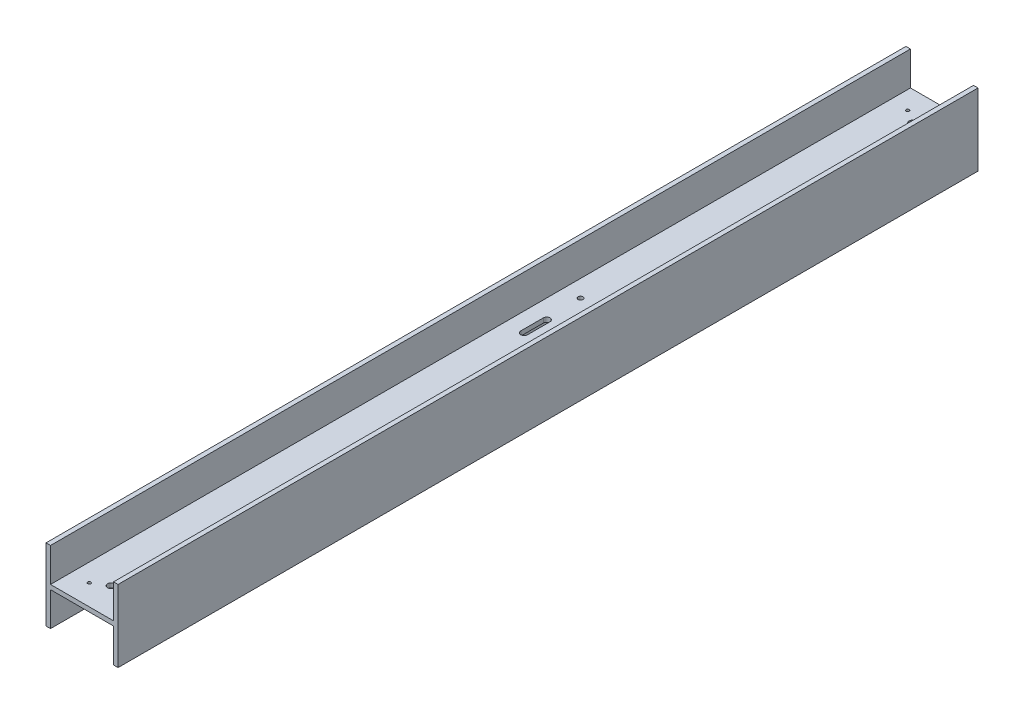
ISO-10303-21;
HEADER;
FILE_DESCRIPTION(('STEP AP214'),'2;1');
FILE_NAME('part.step','',(''),(''),'','','');
FILE_SCHEMA(('AUTOMOTIVE_DESIGN { 1 0 10303 214 1 1 1 1 }'));
ENDSEC;
DATA;
#1=APPLICATION_CONTEXT('core data for automotive mechanical design processes');
#2=APPLICATION_PROTOCOL_DEFINITION('international standard','automotive_design',2000,#1);
#3=PRODUCT_CONTEXT('',#1,'mechanical');
#4=PRODUCT('Part','Part','',(#3));
#5=PRODUCT_RELATED_PRODUCT_CATEGORY('part','',(#4));
#6=PRODUCT_DEFINITION_FORMATION('','',#4);
#7=PRODUCT_DEFINITION_CONTEXT('part definition',#1,'design');
#8=PRODUCT_DEFINITION('design','',#6,#7);
#9=PRODUCT_DEFINITION_SHAPE('','',#8);
#10=(LENGTH_UNIT() NAMED_UNIT(*) SI_UNIT(.MILLI.,.METRE.));
#11=(NAMED_UNIT(*) PLANE_ANGLE_UNIT() SI_UNIT($,.RADIAN.));
#12=(NAMED_UNIT(*) SI_UNIT($,.STERADIAN.) SOLID_ANGLE_UNIT());
#13=UNCERTAINTY_MEASURE_WITH_UNIT(LENGTH_MEASURE(1.E-05),#10,'distance_accuracy_value','');
#14=(GEOMETRIC_REPRESENTATION_CONTEXT(3) GLOBAL_UNCERTAINTY_ASSIGNED_CONTEXT((#13)) GLOBAL_UNIT_ASSIGNED_CONTEXT((#10,
#11,#12)) REPRESENTATION_CONTEXT('',''));
#15=CARTESIAN_POINT('',(0.,0.,0.));
#16=DIRECTION('',(0.,0.,1.));
#17=DIRECTION('',(1.,0.,0.));
#18=AXIS2_PLACEMENT_3D('',#15,#16,#17);
#19=CARTESIAN_POINT('',(-25.4,25.4,303.2125));
#20=DIRECTION('',(0.,-1.,0.));
#21=DIRECTION('',(0.,0.,-1.));
#22=AXIS2_PLACEMENT_3D('',#19,#20,#21);
#23=PLANE('',#22);
#24=DIRECTION('',(-1.,0.,0.));
#25=VECTOR('',#24,1.);
#26=CARTESIAN_POINT('',(-25.4,25.4,-303.2125));
#27=LINE('',#26,#25);
#28=CARTESIAN_POINT('',(-22.225,25.4,-303.2125));
#29=VERTEX_POINT('',#28);
#30=CARTESIAN_POINT('',(-25.4,25.4,-303.2125));
#31=VERTEX_POINT('',#30);
#32=EDGE_CURVE('E190',#29,#31,#27,.T.);
#33=ORIENTED_EDGE('',*,*,#32,.T.);
#34=DIRECTION('',(0.,0.,-1.));
#35=VECTOR('',#34,1.);
#36=CARTESIAN_POINT('',(-25.4,25.4,303.2125));
#37=LINE('',#36,#35);
#38=CARTESIAN_POINT('',(-25.4,25.4,303.2125));
#39=VERTEX_POINT('',#38);
#40=EDGE_CURVE('E273',#39,#31,#37,.T.);
#41=ORIENTED_EDGE('',*,*,#40,.F.);
#42=DIRECTION('',(-1.,0.,0.));
#43=VECTOR('',#42,1.);
#44=CARTESIAN_POINT('',(-25.4,25.4,303.2125));
#45=LINE('',#44,#43);
#46=CARTESIAN_POINT('',(-22.225,25.4,303.2125));
#47=VERTEX_POINT('',#46);
#48=EDGE_CURVE('E191',#47,#39,#45,.T.);
#49=ORIENTED_EDGE('',*,*,#48,.F.);
#50=DIRECTION('',(0.,0.,-1.));
#51=VECTOR('',#50,1.);
#52=CARTESIAN_POINT('',(-22.225,25.4,303.2125));
#53=LINE('',#52,#51);
#54=EDGE_CURVE('E217',#47,#29,#53,.T.);
#55=ORIENTED_EDGE('',*,*,#54,.T.);
#56=EDGE_LOOP('',(#33,#41,#49,#55));
#57=FACE_BOUND('',#56,.T.);
#58=ADVANCED_FACE('F36',(#57),#23,.F.);
#59=CARTESIAN_POINT('',(-25.4,-25.4,303.2125));
#60=DIRECTION('',(1.,0.,0.));
#61=DIRECTION('',(0.,0.,-1.));
#62=AXIS2_PLACEMENT_3D('',#59,#60,#61);
#63=PLANE('',#62);
#64=DIRECTION('',(0.,-1.,0.));
#65=VECTOR('',#64,1.);
#66=CARTESIAN_POINT('',(-25.4,-25.4,-303.2125));
#67=LINE('',#66,#65);
#68=CARTESIAN_POINT('',(-25.4,-25.4,-303.2125));
#69=VERTEX_POINT('',#68);
#70=EDGE_CURVE('E220',#31,#69,#67,.T.);
#71=ORIENTED_EDGE('',*,*,#70,.T.);
#72=DIRECTION('',(0.,0.,-1.));
#73=VECTOR('',#72,1.);
#74=CARTESIAN_POINT('',(-25.4,-25.4,303.2125));
#75=LINE('',#74,#73);
#76=CARTESIAN_POINT('',(-25.4,-25.4,303.2125));
#77=VERTEX_POINT('',#76);
#78=EDGE_CURVE('E270',#77,#69,#75,.T.);
#79=ORIENTED_EDGE('',*,*,#78,.F.);
#80=DIRECTION('',(0.,-1.,0.));
#81=VECTOR('',#80,1.);
#82=CARTESIAN_POINT('',(-25.4,-25.4,303.2125));
#83=LINE('',#82,#81);
#84=EDGE_CURVE('E194',#39,#77,#83,.T.);
#85=ORIENTED_EDGE('',*,*,#84,.F.);
#86=ORIENTED_EDGE('',*,*,#40,.T.);
#87=EDGE_LOOP('',(#71,#79,#85,#86));
#88=FACE_BOUND('',#87,.T.);
#89=ADVANCED_FACE('F358',(#88),#63,.F.);
#90=CARTESIAN_POINT('',(-25.4,-25.4,303.2125));
#91=DIRECTION('',(0.,1.,0.));
#92=DIRECTION('',(0.,0.,1.));
#93=AXIS2_PLACEMENT_3D('',#90,#91,#92);
#94=PLANE('',#93);
#95=DIRECTION('',(1.,0.,0.));
#96=VECTOR('',#95,1.);
#97=CARTESIAN_POINT('',(-25.4,-25.4,-303.2125));
#98=LINE('',#97,#96);
#99=CARTESIAN_POINT('',(-22.225,-25.4,-303.2125));
#100=VERTEX_POINT('',#99);
#101=EDGE_CURVE('E222',#69,#100,#98,.T.);
#102=ORIENTED_EDGE('',*,*,#101,.T.);
#103=DIRECTION('',(0.,0.,-1.));
#104=VECTOR('',#103,1.);
#105=CARTESIAN_POINT('',(-22.225,-25.4,303.2125));
#106=LINE('',#105,#104);
#107=CARTESIAN_POINT('',(-22.225,-25.4,303.2125));
#108=VERTEX_POINT('',#107);
#109=EDGE_CURVE('E267',#108,#100,#106,.T.);
#110=ORIENTED_EDGE('',*,*,#109,.F.);
#111=DIRECTION('',(1.,0.,0.));
#112=VECTOR('',#111,1.);
#113=CARTESIAN_POINT('',(-25.4,-25.4,303.2125));
#114=LINE('',#113,#112);
#115=EDGE_CURVE('E197',#77,#108,#114,.T.);
#116=ORIENTED_EDGE('',*,*,#115,.F.);
#117=ORIENTED_EDGE('',*,*,#78,.T.);
#118=EDGE_LOOP('',(#102,#110,#116,#117));
#119=FACE_BOUND('',#118,.T.);
#120=ADVANCED_FACE('F363',(#119),#94,.F.);
#121=CARTESIAN_POINT('',(-22.225,-25.4,303.2125));
#122=DIRECTION('',(-1.,0.,0.));
#123=DIRECTION('',(0.,-1.,0.));
#124=AXIS2_PLACEMENT_3D('',#121,#122,#123);
#125=PLANE('',#124);
#126=DIRECTION('',(0.,1.,0.));
#127=VECTOR('',#126,1.);
#128=CARTESIAN_POINT('',(-22.225,-25.4,-303.2125));
#129=LINE('',#128,#127);
#130=CARTESIAN_POINT('',(-22.225,-1.58750000000001,-303.2125));
#131=VERTEX_POINT('',#130);
#132=EDGE_CURVE('E224',#100,#131,#129,.T.);
#133=ORIENTED_EDGE('',*,*,#132,.T.);
#134=DIRECTION('',(0.,0.,-1.));
#135=VECTOR('',#134,1.);
#136=CARTESIAN_POINT('',(-22.225,-1.58750000000001,303.2125));
#137=LINE('',#136,#135);
#138=CARTESIAN_POINT('',(-22.225,-1.58750000000001,303.2125));
#139=VERTEX_POINT('',#138);
#140=EDGE_CURVE('E264',#139,#131,#137,.T.);
#141=ORIENTED_EDGE('',*,*,#140,.F.);
#142=DIRECTION('',(0.,1.,0.));
#143=VECTOR('',#142,1.);
#144=CARTESIAN_POINT('',(-22.225,-25.4,303.2125));
#145=LINE('',#144,#143);
#146=EDGE_CURVE('E199',#108,#139,#145,.T.);
#147=ORIENTED_EDGE('',*,*,#146,.F.);
#148=ORIENTED_EDGE('',*,*,#109,.T.);
#149=EDGE_LOOP('',(#133,#141,#147,#148));
#150=FACE_BOUND('',#149,.T.);
#151=ADVANCED_FACE('F417',(#150),#125,.F.);
#152=CARTESIAN_POINT('',(-22.225,-1.58750000000001,303.2125));
#153=DIRECTION('',(0.,1.,0.));
#154=DIRECTION('',(0.,0.,1.));
#155=AXIS2_PLACEMENT_3D('',#152,#153,#154);
#156=PLANE('',#155);
#157=CARTESIAN_POINT('',(0.,-1.58750000000001,228.6));
#158=DIRECTION('',(0.,-1.,0.));
#159=DIRECTION('',(0.,0.,-1.));
#160=AXIS2_PLACEMENT_3D('',#157,#158,#159);
#161=CIRCLE('',#160,1.09220000000001);
#162=CARTESIAN_POINT('',(0.,-1.58750000000001,227.5078));
#163=VERTEX_POINT('',#162);
#164=EDGE_CURVE('E301',#163,#163,#161,.T.);
#165=ORIENTED_EDGE('',*,*,#164,.F.);
#166=EDGE_LOOP('',(#165));
#167=FACE_BOUND('',#166,.T.);
#168=CARTESIAN_POINT('',(0.,-1.58750000000001,146.05));
#169=DIRECTION('',(0.,-1.,0.));
#170=DIRECTION('',(0.,0.,-1.));
#171=AXIS2_PLACEMENT_3D('',#168,#169,#170);
#172=CIRCLE('',#171,1.09220000000001);
#173=CARTESIAN_POINT('',(0.,-1.58750000000001,144.9578));
#174=VERTEX_POINT('',#173);
#175=EDGE_CURVE('E291',#174,#174,#172,.T.);
#176=ORIENTED_EDGE('',*,*,#175,.F.);
#177=EDGE_LOOP('',(#176));
#178=FACE_BOUND('',#177,.T.);
#179=CARTESIAN_POINT('',(0.,-1.58750000000001,-146.05));
#180=DIRECTION('',(0.,-1.,0.));
#181=DIRECTION('',(0.,0.,-1.));
#182=AXIS2_PLACEMENT_3D('',#179,#180,#181);
#183=CIRCLE('',#182,1.09220000000001);
#184=CARTESIAN_POINT('',(0.,-1.58750000000001,-147.1422));
#185=VERTEX_POINT('',#184);
#186=EDGE_CURVE('E288',#185,#185,#183,.T.);
#187=ORIENTED_EDGE('',*,*,#186,.F.);
#188=EDGE_LOOP('',(#187));
#189=FACE_BOUND('',#188,.T.);
#190=CARTESIAN_POINT('',(0.,-1.58750000000001,-228.6));
#191=DIRECTION('',(0.,-1.,0.));
#192=DIRECTION('',(0.,0.,-1.));
#193=AXIS2_PLACEMENT_3D('',#190,#191,#192);
#194=CIRCLE('',#193,1.09220000000001);
#195=CARTESIAN_POINT('',(0.,-1.58750000000001,-229.6922));
#196=VERTEX_POINT('',#195);
#197=EDGE_CURVE('E285',#196,#196,#194,.T.);
#198=ORIENTED_EDGE('',*,*,#197,.F.);
#199=EDGE_LOOP('',(#198));
#200=FACE_BOUND('',#199,.T.);
#201=CARTESIAN_POINT('',(0.,-1.58750000000001,-282.575));
#202=DIRECTION('',(0.,1.,0.));
#203=DIRECTION('',(0.,0.,1.));
#204=AXIS2_PLACEMENT_3D('',#201,#202,#203);
#205=CIRCLE('',#204,2.5527);
#206=CARTESIAN_POINT('',(0.,-1.58750000000001,-280.0223));
#207=VERTEX_POINT('',#206);
#208=EDGE_CURVE('E308',#207,#207,#205,.T.);
#209=ORIENTED_EDGE('',*,*,#208,.T.);
#210=EDGE_LOOP('',(#209));
#211=FACE_BOUND('',#210,.T.);
#212=CARTESIAN_POINT('',(0.,-1.58750000000001,282.575));
#213=DIRECTION('',(0.,1.,0.));
#214=DIRECTION('',(0.,0.,1.));
#215=AXIS2_PLACEMENT_3D('',#212,#213,#214);
#216=CIRCLE('',#215,2.5527);
#217=CARTESIAN_POINT('',(0.,-1.58750000000001,285.1277));
#218=VERTEX_POINT('',#217);
#219=EDGE_CURVE('E314',#218,#218,#216,.T.);
#220=ORIENTED_EDGE('',*,*,#219,.T.);
#221=EDGE_LOOP('',(#220));
#222=FACE_BOUND('',#221,.T.);
#223=CARTESIAN_POINT('',(-9.52499999984012,-1.58750000000001,-288.544));
#224=DIRECTION('',(0.,1.,0.));
#225=DIRECTION('',(0.,0.,1.));
#226=AXIS2_PLACEMENT_3D('',#223,#224,#225);
#227=CIRCLE('',#226,1.09219999985166);
#228=CARTESIAN_POINT('',(-9.52499999984012,-1.58750000000001,-287.451800000148));
#229=VERTEX_POINT('',#228);
#230=EDGE_CURVE('E320',#229,#229,#227,.T.);
#231=ORIENTED_EDGE('',*,*,#230,.T.);
#232=EDGE_LOOP('',(#231));
#233=FACE_BOUND('',#232,.T.);
#234=CARTESIAN_POINT('',(9.52499999984005,-1.58750000000001,-288.544));
#235=DIRECTION('',(0.,1.,0.));
#236=DIRECTION('',(0.,0.,1.));
#237=AXIS2_PLACEMENT_3D('',#234,#235,#236);
#238=CIRCLE('',#237,1.09219999985173);
#239=CARTESIAN_POINT('',(9.52499999984005,-1.58750000000001,-287.451800000148));
#240=VERTEX_POINT('',#239);
#241=EDGE_CURVE('E326',#240,#240,#238,.T.);
#242=ORIENTED_EDGE('',*,*,#241,.T.);
#243=EDGE_LOOP('',(#242));
#244=FACE_BOUND('',#243,.T.);
#245=CARTESIAN_POINT('',(9.52499999984012,-1.58750000000001,288.544));
#246=DIRECTION('',(0.,1.,0.));
#247=DIRECTION('',(0.,0.,1.));
#248=AXIS2_PLACEMENT_3D('',#245,#246,#247);
#249=CIRCLE('',#248,1.09219999985173);
#250=CARTESIAN_POINT('',(9.52499999984012,-1.58750000000001,289.636199999852));
#251=VERTEX_POINT('',#250);
#252=EDGE_CURVE('E332',#251,#251,#249,.T.);
#253=ORIENTED_EDGE('',*,*,#252,.T.);
#254=EDGE_LOOP('',(#253));
#255=FACE_BOUND('',#254,.T.);
#256=CARTESIAN_POINT('',(-9.52499999984005,-1.58750000000001,288.544));
#257=DIRECTION('',(0.,1.,0.));
#258=DIRECTION('',(0.,0.,1.));
#259=AXIS2_PLACEMENT_3D('',#256,#257,#258);
#260=CIRCLE('',#259,1.09219999985166);
#261=CARTESIAN_POINT('',(-9.52499999984005,-1.58750000000001,289.636199999852));
#262=VERTEX_POINT('',#261);
#263=EDGE_CURVE('E338',#262,#262,#260,.T.);
#264=ORIENTED_EDGE('',*,*,#263,.T.);
#265=EDGE_LOOP('',(#264));
#266=FACE_BOUND('',#265,.T.);
#267=DIRECTION('',(0.,0.,1.));
#268=VECTOR('',#267,1.);
#269=CARTESIAN_POINT('',(-6.50874999999999,-1.58750000000001,-33.3375));
#270=LINE('',#269,#268);
#271=CARTESIAN_POINT('',(-6.50874999999999,-1.58750000000001,-33.3375));
#272=VERTEX_POINT('',#271);
#273=CARTESIAN_POINT('',(-6.50874999999999,-1.58750000000001,-17.4625));
#274=VERTEX_POINT('',#273);
#275=EDGE_CURVE('E162',#272,#274,#270,.T.);
#276=ORIENTED_EDGE('',*,*,#275,.F.);
#277=CARTESIAN_POINT('',(-8.88999999999999,-1.58750000000001,-33.3375));
#278=DIRECTION('',(0.,-1.,0.));
#279=DIRECTION('',(0.,0.,-1.));
#280=AXIS2_PLACEMENT_3D('',#277,#278,#279);
#281=CIRCLE('',#280,2.38125);
#282=CARTESIAN_POINT('',(-11.27125,-1.58750000000001,-33.3375));
#283=VERTEX_POINT('',#282);
#284=EDGE_CURVE('E52',#283,#272,#281,.T.);
#285=ORIENTED_EDGE('',*,*,#284,.F.);
#286=DIRECTION('',(0.,0.,-1.));
#287=VECTOR('',#286,1.);
#288=CARTESIAN_POINT('',(-11.27125,-1.58750000000001,-33.3375));
#289=LINE('',#288,#287);
#290=CARTESIAN_POINT('',(-11.27125,-1.58750000000001,-17.4625));
#291=VERTEX_POINT('',#290);
#292=EDGE_CURVE('E169',#291,#283,#289,.T.);
#293=ORIENTED_EDGE('',*,*,#292,.F.);
#294=CARTESIAN_POINT('',(-8.88999999999999,-1.58750000000001,-17.4625));
#295=DIRECTION('',(0.,-1.,0.));
#296=DIRECTION('',(0.,0.,-1.));
#297=AXIS2_PLACEMENT_3D('',#294,#295,#296);
#298=CIRCLE('',#297,2.38125);
#299=EDGE_CURVE('E153',#274,#291,#298,.T.);
#300=ORIENTED_EDGE('',*,*,#299,.F.);
#301=EDGE_LOOP('',(#276,#285,#293,#300));
#302=FACE_BOUND('',#301,.T.);
#303=CARTESIAN_POINT('',(-10.16,-1.58750000000001,-58.547));
#304=DIRECTION('',(0.,1.,0.));
#305=DIRECTION('',(0.,0.,1.));
#306=AXIS2_PLACEMENT_3D('',#303,#304,#305);
#307=CIRCLE('',#306,1.7272);
#308=CARTESIAN_POINT('',(-10.16,-1.58750000000001,-56.8198));
#309=VERTEX_POINT('',#308);
#310=EDGE_CURVE('E181',#309,#309,#307,.T.);
#311=ORIENTED_EDGE('',*,*,#310,.T.);
#312=EDGE_LOOP('',(#311));
#313=FACE_BOUND('',#312,.T.);
#314=CARTESIAN_POINT('',(10.1600000000004,-1.58750000000001,58.5469999999999));
#315=DIRECTION('',(0.,1.,0.));
#316=DIRECTION('',(0.,0.,1.));
#317=AXIS2_PLACEMENT_3D('',#314,#315,#316);
#318=CIRCLE('',#317,1.7272);
#319=CARTESIAN_POINT('',(10.1600000000004,-1.58750000000001,60.2741999999999));
#320=VERTEX_POINT('',#319);
#321=EDGE_CURVE('E187',#320,#320,#318,.T.);
#322=ORIENTED_EDGE('',*,*,#321,.T.);
#323=EDGE_LOOP('',(#322));
#324=FACE_BOUND('',#323,.T.);
#325=DIRECTION('',(1.,0.,0.));
#326=VECTOR('',#325,1.);
#327=CARTESIAN_POINT('',(-22.225,-1.58750000000001,-303.2125));
#328=LINE('',#327,#326);
#329=CARTESIAN_POINT('',(22.225,-1.58750000000001,-303.2125));
#330=VERTEX_POINT('',#329);
#331=EDGE_CURVE('E226',#131,#330,#328,.T.);
#332=ORIENTED_EDGE('',*,*,#331,.T.);
#333=DIRECTION('',(0.,0.,-1.));
#334=VECTOR('',#333,1.);
#335=CARTESIAN_POINT('',(22.225,-1.58750000000001,303.2125));
#336=LINE('',#335,#334);
#337=CARTESIAN_POINT('',(22.225,-1.58750000000001,303.2125));
#338=VERTEX_POINT('',#337);
#339=EDGE_CURVE('E261',#338,#330,#336,.T.);
#340=ORIENTED_EDGE('',*,*,#339,.F.);
#341=DIRECTION('',(1.,0.,0.));
#342=VECTOR('',#341,1.);
#343=CARTESIAN_POINT('',(-22.225,-1.58750000000001,303.2125));
#344=LINE('',#343,#342);
#345=EDGE_CURVE('E201',#139,#338,#344,.T.);
#346=ORIENTED_EDGE('',*,*,#345,.F.);
#347=ORIENTED_EDGE('',*,*,#140,.T.);
#348=EDGE_LOOP('',(#332,#340,#346,#347));
#349=FACE_BOUND('',#348,.T.);
#350=ADVANCED_FACE('F166',(#167,#178,#189,#200,#211,#222,#233,#244,#255,#266,#302,#313,#324,
#349),#156,.F.);
#351=CARTESIAN_POINT('',(22.225,-25.4,303.2125));
#352=DIRECTION('',(1.,0.,0.));
#353=DIRECTION('',(0.,1.,0.));
#354=AXIS2_PLACEMENT_3D('',#351,#352,#353);
#355=PLANE('',#354);
#356=DIRECTION('',(0.,-1.,0.));
#357=VECTOR('',#356,1.);
#358=CARTESIAN_POINT('',(22.225,-25.4,-303.2125));
#359=LINE('',#358,#357);
#360=CARTESIAN_POINT('',(22.225,-25.4,-303.2125));
#361=VERTEX_POINT('',#360);
#362=EDGE_CURVE('E228',#330,#361,#359,.T.);
#363=ORIENTED_EDGE('',*,*,#362,.T.);
#364=DIRECTION('',(0.,0.,-1.));
#365=VECTOR('',#364,1.);
#366=CARTESIAN_POINT('',(22.225,-25.4,303.2125));
#367=LINE('',#366,#365);
#368=CARTESIAN_POINT('',(22.225,-25.4,303.2125));
#369=VERTEX_POINT('',#368);
#370=EDGE_CURVE('E258',#369,#361,#367,.T.);
#371=ORIENTED_EDGE('',*,*,#370,.F.);
#372=DIRECTION('',(0.,-1.,0.));
#373=VECTOR('',#372,1.);
#374=CARTESIAN_POINT('',(22.225,-25.4,303.2125));
#375=LINE('',#374,#373);
#376=EDGE_CURVE('E203',#338,#369,#375,.T.);
#377=ORIENTED_EDGE('',*,*,#376,.F.);
#378=ORIENTED_EDGE('',*,*,#339,.T.);
#379=EDGE_LOOP('',(#363,#371,#377,#378));
#380=FACE_BOUND('',#379,.T.);
#381=ADVANCED_FACE('F411',(#380),#355,.F.);
#382=CARTESIAN_POINT('',(25.4,-25.4,303.2125));
#383=DIRECTION('',(0.,1.,0.));
#384=DIRECTION('',(0.,0.,1.));
#385=AXIS2_PLACEMENT_3D('',#382,#383,#384);
#386=PLANE('',#385);
#387=DIRECTION('',(1.,0.,0.));
#388=VECTOR('',#387,1.);
#389=CARTESIAN_POINT('',(25.4,-25.4,-303.2125));
#390=LINE('',#389,#388);
#391=CARTESIAN_POINT('',(25.4,-25.4,-303.2125));
#392=VERTEX_POINT('',#391);
#393=EDGE_CURVE('E230',#361,#392,#390,.T.);
#394=ORIENTED_EDGE('',*,*,#393,.T.);
#395=DIRECTION('',(0.,0.,-1.));
#396=VECTOR('',#395,1.);
#397=CARTESIAN_POINT('',(25.4,-25.4,303.2125));
#398=LINE('',#397,#396);
#399=CARTESIAN_POINT('',(25.4,-25.4,303.2125));
#400=VERTEX_POINT('',#399);
#401=EDGE_CURVE('E255',#400,#392,#398,.T.);
#402=ORIENTED_EDGE('',*,*,#401,.F.);
#403=DIRECTION('',(1.,0.,0.));
#404=VECTOR('',#403,1.);
#405=CARTESIAN_POINT('',(25.4,-25.4,303.2125));
#406=LINE('',#405,#404);
#407=EDGE_CURVE('E205',#369,#400,#406,.T.);
#408=ORIENTED_EDGE('',*,*,#407,.F.);
#409=ORIENTED_EDGE('',*,*,#370,.T.);
#410=EDGE_LOOP('',(#394,#402,#408,#409));
#411=FACE_BOUND('',#410,.T.);
#412=ADVANCED_FACE('F406',(#411),#386,.F.);
#413=CARTESIAN_POINT('',(25.4,-25.4,303.2125));
#414=DIRECTION('',(-1.,0.,0.));
#415=DIRECTION('',(0.,0.,1.));
#416=AXIS2_PLACEMENT_3D('',#413,#414,#415);
#417=PLANE('',#416);
#418=DIRECTION('',(0.,1.,0.));
#419=VECTOR('',#418,1.);
#420=CARTESIAN_POINT('',(25.4,-25.4,-303.2125));
#421=LINE('',#420,#419);
#422=CARTESIAN_POINT('',(25.4,25.4,-303.2125));
#423=VERTEX_POINT('',#422);
#424=EDGE_CURVE('E232',#392,#423,#421,.T.);
#425=ORIENTED_EDGE('',*,*,#424,.T.);
#426=DIRECTION('',(0.,0.,-1.));
#427=VECTOR('',#426,1.);
#428=CARTESIAN_POINT('',(25.4,25.4,303.2125));
#429=LINE('',#428,#427);
#430=CARTESIAN_POINT('',(25.4,25.4,303.2125));
#431=VERTEX_POINT('',#430);
#432=EDGE_CURVE('E252',#431,#423,#429,.T.);
#433=ORIENTED_EDGE('',*,*,#432,.F.);
#434=DIRECTION('',(0.,1.,0.));
#435=VECTOR('',#434,1.);
#436=CARTESIAN_POINT('',(25.4,-25.4,303.2125));
#437=LINE('',#436,#435);
#438=EDGE_CURVE('E207',#400,#431,#437,.T.);
#439=ORIENTED_EDGE('',*,*,#438,.F.);
#440=ORIENTED_EDGE('',*,*,#401,.T.);
#441=EDGE_LOOP('',(#425,#433,#439,#440));
#442=FACE_BOUND('',#441,.T.);
#443=ADVANCED_FACE('F400',(#442),#417,.F.);
#444=CARTESIAN_POINT('',(25.4,25.4,303.2125));
#445=DIRECTION('',(0.,-1.,0.));
#446=DIRECTION('',(0.,0.,-1.));
#447=AXIS2_PLACEMENT_3D('',#444,#445,#446);
#448=PLANE('',#447);
#449=DIRECTION('',(-1.,0.,0.));
#450=VECTOR('',#449,1.);
#451=CARTESIAN_POINT('',(25.4,25.4,-303.2125));
#452=LINE('',#451,#450);
#453=CARTESIAN_POINT('',(22.225,25.4,-303.2125));
#454=VERTEX_POINT('',#453);
#455=EDGE_CURVE('E234',#423,#454,#452,.T.);
#456=ORIENTED_EDGE('',*,*,#455,.T.);
#457=DIRECTION('',(0.,0.,-1.));
#458=VECTOR('',#457,1.);
#459=CARTESIAN_POINT('',(22.225,25.4,303.2125));
#460=LINE('',#459,#458);
#461=CARTESIAN_POINT('',(22.225,25.4,303.2125));
#462=VERTEX_POINT('',#461);
#463=EDGE_CURVE('E249',#462,#454,#460,.T.);
#464=ORIENTED_EDGE('',*,*,#463,.F.);
#465=DIRECTION('',(-1.,0.,0.));
#466=VECTOR('',#465,1.);
#467=CARTESIAN_POINT('',(25.4,25.4,303.2125));
#468=LINE('',#467,#466);
#469=EDGE_CURVE('E209',#431,#462,#468,.T.);
#470=ORIENTED_EDGE('',*,*,#469,.F.);
#471=ORIENTED_EDGE('',*,*,#432,.T.);
#472=EDGE_LOOP('',(#456,#464,#470,#471));
#473=FACE_BOUND('',#472,.T.);
#474=ADVANCED_FACE('F396',(#473),#448,.F.);
#475=CARTESIAN_POINT('',(22.225,25.4,303.2125));
#476=DIRECTION('',(1.,0.,0.));
#477=DIRECTION('',(0.,1.,0.));
#478=AXIS2_PLACEMENT_3D('',#475,#476,#477);
#479=PLANE('',#478);
#480=DIRECTION('',(0.,-1.,0.));
#481=VECTOR('',#480,1.);
#482=CARTESIAN_POINT('',(22.225,25.4,-303.2125));
#483=LINE('',#482,#481);
#484=CARTESIAN_POINT('',(22.225,1.58750000000001,-303.2125));
#485=VERTEX_POINT('',#484);
#486=EDGE_CURVE('E236',#454,#485,#483,.T.);
#487=ORIENTED_EDGE('',*,*,#486,.T.);
#488=DIRECTION('',(0.,0.,-1.));
#489=VECTOR('',#488,1.);
#490=CARTESIAN_POINT('',(22.225,1.58750000000001,303.2125));
#491=LINE('',#490,#489);
#492=CARTESIAN_POINT('',(22.225,1.58750000000001,303.2125));
#493=VERTEX_POINT('',#492);
#494=EDGE_CURVE('E246',#493,#485,#491,.T.);
#495=ORIENTED_EDGE('',*,*,#494,.F.);
#496=DIRECTION('',(0.,-1.,0.));
#497=VECTOR('',#496,1.);
#498=CARTESIAN_POINT('',(22.225,25.4,303.2125));
#499=LINE('',#498,#497);
#500=EDGE_CURVE('E211',#462,#493,#499,.T.);
#501=ORIENTED_EDGE('',*,*,#500,.F.);
#502=ORIENTED_EDGE('',*,*,#463,.T.);
#503=EDGE_LOOP('',(#487,#495,#501,#502));
#504=FACE_BOUND('',#503,.T.);
#505=ADVANCED_FACE('F391',(#504),#479,.F.);
#506=CARTESIAN_POINT('',(-22.225,1.58750000000001,303.2125));
#507=DIRECTION('',(0.,-1.,0.));
#508=DIRECTION('',(0.,0.,-1.));
#509=AXIS2_PLACEMENT_3D('',#506,#507,#508);
#510=PLANE('',#509);
#511=CARTESIAN_POINT('',(0.,1.58750000000001,228.6));
#512=DIRECTION('',(0.,-1.,0.));
#513=DIRECTION('',(0.,0.,-1.));
#514=AXIS2_PLACEMENT_3D('',#511,#512,#513);
#515=CIRCLE('',#514,1.09220000000001);
#516=CARTESIAN_POINT('',(0.,1.58750000000001,227.5078));
#517=VERTEX_POINT('',#516);
#518=EDGE_CURVE('E39',#517,#517,#515,.T.);
#519=ORIENTED_EDGE('',*,*,#518,.T.);
#520=EDGE_LOOP('',(#519));
#521=FACE_BOUND('',#520,.T.);
#522=CARTESIAN_POINT('',(0.,1.58750000000001,146.05));
#523=DIRECTION('',(0.,-1.,0.));
#524=DIRECTION('',(0.,0.,-1.));
#525=AXIS2_PLACEMENT_3D('',#522,#523,#524);
#526=CIRCLE('',#525,1.09220000000001);
#527=CARTESIAN_POINT('',(0.,1.58750000000001,144.9578));
#528=VERTEX_POINT('',#527);
#529=EDGE_CURVE('E289',#528,#528,#526,.T.);
#530=ORIENTED_EDGE('',*,*,#529,.T.);
#531=EDGE_LOOP('',(#530));
#532=FACE_BOUND('',#531,.T.);
#533=CARTESIAN_POINT('',(0.,1.58750000000001,-146.05));
#534=DIRECTION('',(0.,-1.,0.));
#535=DIRECTION('',(0.,0.,-1.));
#536=AXIS2_PLACEMENT_3D('',#533,#534,#535);
#537=CIRCLE('',#536,1.09220000000001);
#538=CARTESIAN_POINT('',(0.,1.58750000000001,-147.1422));
#539=VERTEX_POINT('',#538);
#540=EDGE_CURVE('E286',#539,#539,#537,.T.);
#541=ORIENTED_EDGE('',*,*,#540,.T.);
#542=EDGE_LOOP('',(#541));
#543=FACE_BOUND('',#542,.T.);
#544=CARTESIAN_POINT('',(0.,1.58750000000001,-228.6));
#545=DIRECTION('',(0.,-1.,0.));
#546=DIRECTION('',(0.,0.,-1.));
#547=AXIS2_PLACEMENT_3D('',#544,#545,#546);
#548=CIRCLE('',#547,1.09220000000001);
#549=CARTESIAN_POINT('',(0.,1.58750000000001,-229.6922));
#550=VERTEX_POINT('',#549);
#551=EDGE_CURVE('E281',#550,#550,#548,.T.);
#552=ORIENTED_EDGE('',*,*,#551,.T.);
#553=EDGE_LOOP('',(#552));
#554=FACE_BOUND('',#553,.T.);
#555=CARTESIAN_POINT('',(0.,1.58750000000001,-282.575));
#556=DIRECTION('',(0.,1.,0.));
#557=DIRECTION('',(0.,0.,1.));
#558=AXIS2_PLACEMENT_3D('',#555,#556,#557);
#559=CIRCLE('',#558,2.5527);
#560=CARTESIAN_POINT('',(0.,1.58750000000001,-280.0223));
#561=VERTEX_POINT('',#560);
#562=EDGE_CURVE('E284',#561,#561,#559,.T.);
#563=ORIENTED_EDGE('',*,*,#562,.F.);
#564=EDGE_LOOP('',(#563));
#565=FACE_BOUND('',#564,.T.);
#566=CARTESIAN_POINT('',(0.,1.58750000000001,282.575));
#567=DIRECTION('',(0.,1.,0.));
#568=DIRECTION('',(0.,0.,1.));
#569=AXIS2_PLACEMENT_3D('',#566,#567,#568);
#570=CIRCLE('',#569,2.5527);
#571=CARTESIAN_POINT('',(0.,1.58750000000001,285.1277));
#572=VERTEX_POINT('',#571);
#573=EDGE_CURVE('E311',#572,#572,#570,.T.);
#574=ORIENTED_EDGE('',*,*,#573,.F.);
#575=EDGE_LOOP('',(#574));
#576=FACE_BOUND('',#575,.T.);
#577=CARTESIAN_POINT('',(-9.52499999984012,1.58750000000001,-288.544));
#578=DIRECTION('',(0.,1.,0.));
#579=DIRECTION('',(0.,0.,-1.));
#580=AXIS2_PLACEMENT_3D('',#577,#578,#579);
#581=CIRCLE('',#580,1.09219999985166);
#582=CARTESIAN_POINT('',(-9.52499999984012,1.58750000000001,-289.636199999852));
#583=VERTEX_POINT('',#582);
#584=EDGE_CURVE('E317',#583,#583,#581,.T.);
#585=ORIENTED_EDGE('',*,*,#584,.F.);
#586=EDGE_LOOP('',(#585));
#587=FACE_BOUND('',#586,.T.);
#588=CARTESIAN_POINT('',(9.52499999984005,1.58750000000001,-288.544));
#589=DIRECTION('',(0.,1.,0.));
#590=DIRECTION('',(0.,0.,1.));
#591=AXIS2_PLACEMENT_3D('',#588,#589,#590);
#592=CIRCLE('',#591,1.09219999985173);
#593=CARTESIAN_POINT('',(9.52499999984005,1.58750000000001,-287.451800000148));
#594=VERTEX_POINT('',#593);
#595=EDGE_CURVE('E323',#594,#594,#592,.T.);
#596=ORIENTED_EDGE('',*,*,#595,.F.);
#597=EDGE_LOOP('',(#596));
#598=FACE_BOUND('',#597,.T.);
#599=CARTESIAN_POINT('',(9.52499999984012,1.58750000000001,288.544));
#600=DIRECTION('',(0.,1.,0.));
#601=DIRECTION('',(0.,0.,-1.));
#602=AXIS2_PLACEMENT_3D('',#599,#600,#601);
#603=CIRCLE('',#602,1.09219999985173);
#604=CARTESIAN_POINT('',(9.52499999984012,1.58750000000001,287.451800000148));
#605=VERTEX_POINT('',#604);
#606=EDGE_CURVE('E329',#605,#605,#603,.T.);
#607=ORIENTED_EDGE('',*,*,#606,.F.);
#608=EDGE_LOOP('',(#607));
#609=FACE_BOUND('',#608,.T.);
#610=CARTESIAN_POINT('',(-9.52499999984005,1.58750000000001,288.544));
#611=DIRECTION('',(0.,1.,0.));
#612=DIRECTION('',(0.,0.,1.));
#613=AXIS2_PLACEMENT_3D('',#610,#611,#612);
#614=CIRCLE('',#613,1.09219999985166);
#615=CARTESIAN_POINT('',(-9.52499999984005,1.58750000000001,289.636199999852));
#616=VERTEX_POINT('',#615);
#617=EDGE_CURVE('E335',#616,#616,#614,.T.);
#618=ORIENTED_EDGE('',*,*,#617,.F.);
#619=EDGE_LOOP('',(#618));
#620=FACE_BOUND('',#619,.T.);
#621=DIRECTION('',(0.,0.,-1.));
#622=VECTOR('',#621,1.);
#623=CARTESIAN_POINT('',(-11.27125,1.58750000000001,303.2125));
#624=LINE('',#623,#622);
#625=CARTESIAN_POINT('',(-11.27125,1.58750000000001,-17.4625));
#626=VERTEX_POINT('',#625);
#627=CARTESIAN_POINT('',(-11.27125,1.58750000000001,-33.3375));
#628=VERTEX_POINT('',#627);
#629=EDGE_CURVE('E44',#626,#628,#624,.T.);
#630=ORIENTED_EDGE('',*,*,#629,.T.);
#631=CARTESIAN_POINT('',(-8.88999999999999,1.58750000000001,-33.3375));
#632=DIRECTION('',(0.,-1.,0.));
#633=DIRECTION('',(0.,0.,-1.));
#634=AXIS2_PLACEMENT_3D('',#631,#632,#633);
#635=CIRCLE('',#634,2.38125);
#636=CARTESIAN_POINT('',(-6.50874999999999,1.58750000000001,-33.3375));
#637=VERTEX_POINT('',#636);
#638=EDGE_CURVE('E11',#628,#637,#635,.T.);
#639=ORIENTED_EDGE('',*,*,#638,.T.);
#640=DIRECTION('',(0.,0.,1.));
#641=VECTOR('',#640,1.);
#642=CARTESIAN_POINT('',(-6.50874999999999,1.58750000000001,303.2125));
#643=LINE('',#642,#641);
#644=CARTESIAN_POINT('',(-6.50874999999999,1.58750000000001,-17.4625));
#645=VERTEX_POINT('',#644);
#646=EDGE_CURVE('E276',#637,#645,#643,.T.);
#647=ORIENTED_EDGE('',*,*,#646,.T.);
#648=CARTESIAN_POINT('',(-8.88999999999999,1.58750000000001,-17.4625));
#649=DIRECTION('',(0.,-1.,0.));
#650=DIRECTION('',(0.,0.,-1.));
#651=AXIS2_PLACEMENT_3D('',#648,#649,#650);
#652=CIRCLE('',#651,2.38125);
#653=EDGE_CURVE('E156',#645,#626,#652,.T.);
#654=ORIENTED_EDGE('',*,*,#653,.T.);
#655=EDGE_LOOP('',(#630,#639,#647,#654));
#656=FACE_BOUND('',#655,.T.);
#657=CARTESIAN_POINT('',(-10.16,1.58750000000001,-58.547));
#658=DIRECTION('',(0.,1.,0.));
#659=DIRECTION('',(0.,0.,1.));
#660=AXIS2_PLACEMENT_3D('',#657,#658,#659);
#661=CIRCLE('',#660,1.7272);
#662=CARTESIAN_POINT('',(-10.16,1.58750000000001,-56.8198));
#663=VERTEX_POINT('',#662);
#664=EDGE_CURVE('E176',#663,#663,#661,.T.);
#665=ORIENTED_EDGE('',*,*,#664,.F.);
#666=EDGE_LOOP('',(#665));
#667=FACE_BOUND('',#666,.T.);
#668=CARTESIAN_POINT('',(10.1600000000004,1.58750000000001,58.5469999999999));
#669=DIRECTION('',(0.,1.,0.));
#670=DIRECTION('',(0.,0.,1.));
#671=AXIS2_PLACEMENT_3D('',#668,#669,#670);
#672=CIRCLE('',#671,1.7272);
#673=CARTESIAN_POINT('',(10.1600000000004,1.58750000000001,60.2741999999999));
#674=VERTEX_POINT('',#673);
#675=EDGE_CURVE('E184',#674,#674,#672,.T.);
#676=ORIENTED_EDGE('',*,*,#675,.F.);
#677=EDGE_LOOP('',(#676));
#678=FACE_BOUND('',#677,.T.);
#679=DIRECTION('',(-1.,0.,0.));
#680=VECTOR('',#679,1.);
#681=CARTESIAN_POINT('',(-22.225,1.58750000000001,-303.2125));
#682=LINE('',#681,#680);
#683=CARTESIAN_POINT('',(-22.225,1.58750000000001,-303.2125));
#684=VERTEX_POINT('',#683);
#685=EDGE_CURVE('E238',#485,#684,#682,.T.);
#686=ORIENTED_EDGE('',*,*,#685,.T.);
#687=DIRECTION('',(0.,0.,-1.));
#688=VECTOR('',#687,1.);
#689=CARTESIAN_POINT('',(-22.225,1.58750000000001,303.2125));
#690=LINE('',#689,#688);
#691=CARTESIAN_POINT('',(-22.225,1.58750000000001,303.2125));
#692=VERTEX_POINT('',#691);
#693=EDGE_CURVE('E243',#692,#684,#690,.T.);
#694=ORIENTED_EDGE('',*,*,#693,.F.);
#695=DIRECTION('',(-1.,0.,0.));
#696=VECTOR('',#695,1.);
#697=CARTESIAN_POINT('',(-22.225,1.58750000000001,303.2125));
#698=LINE('',#697,#696);
#699=EDGE_CURVE('E213',#493,#692,#698,.T.);
#700=ORIENTED_EDGE('',*,*,#699,.F.);
#701=ORIENTED_EDGE('',*,*,#494,.T.);
#702=EDGE_LOOP('',(#686,#694,#700,#701));
#703=FACE_BOUND('',#702,.T.);
#704=ADVANCED_FACE('F385',(#521,#532,#543,#554,#565,#576,#587,#598,#609,#620,#656,#667,#678,
#703),#510,.F.);
#705=CARTESIAN_POINT('',(-22.225,25.4,303.2125));
#706=DIRECTION('',(-1.,0.,0.));
#707=DIRECTION('',(0.,-1.,0.));
#708=AXIS2_PLACEMENT_3D('',#705,#706,#707);
#709=PLANE('',#708);
#710=DIRECTION('',(0.,1.,0.));
#711=VECTOR('',#710,1.);
#712=CARTESIAN_POINT('',(-22.225,25.4,-303.2125));
#713=LINE('',#712,#711);
#714=EDGE_CURVE('E195',#684,#29,#713,.T.);
#715=ORIENTED_EDGE('',*,*,#714,.T.);
#716=ORIENTED_EDGE('',*,*,#54,.F.);
#717=DIRECTION('',(0.,1.,0.));
#718=VECTOR('',#717,1.);
#719=CARTESIAN_POINT('',(-22.225,25.4,303.2125));
#720=LINE('',#719,#718);
#721=EDGE_CURVE('E215',#692,#47,#720,.T.);
#722=ORIENTED_EDGE('',*,*,#721,.F.);
#723=ORIENTED_EDGE('',*,*,#693,.T.);
#724=EDGE_LOOP('',(#715,#716,#722,#723));
#725=FACE_BOUND('',#724,.T.);
#726=ADVANCED_FACE('F383',(#725),#709,.F.);
#727=CARTESIAN_POINT('',(0.,0.,303.2125));
#728=DIRECTION('',(0.,0.,-1.));
#729=DIRECTION('',(-1.,0.,0.));
#730=AXIS2_PLACEMENT_3D('',#727,#728,#729);
#731=PLANE('',#730);
#732=ORIENTED_EDGE('',*,*,#48,.T.);
#733=ORIENTED_EDGE('',*,*,#84,.T.);
#734=ORIENTED_EDGE('',*,*,#115,.T.);
#735=ORIENTED_EDGE('',*,*,#146,.T.);
#736=ORIENTED_EDGE('',*,*,#345,.T.);
#737=ORIENTED_EDGE('',*,*,#376,.T.);
#738=ORIENTED_EDGE('',*,*,#407,.T.);
#739=ORIENTED_EDGE('',*,*,#438,.T.);
#740=ORIENTED_EDGE('',*,*,#469,.T.);
#741=ORIENTED_EDGE('',*,*,#500,.T.);
#742=ORIENTED_EDGE('',*,*,#699,.T.);
#743=ORIENTED_EDGE('',*,*,#721,.T.);
#744=EDGE_LOOP('',(#732,#733,#734,#735,#736,#737,#738,#739,#740,#741,#742,#743));
#745=FACE_BOUND('',#744,.T.);
#746=ADVANCED_FACE('F378',(#745),#731,.F.);
#747=CARTESIAN_POINT('',(0.,0.,-303.2125));
#748=DIRECTION('',(0.,0.,-1.));
#749=DIRECTION('',(-1.,0.,0.));
#750=AXIS2_PLACEMENT_3D('',#747,#748,#749);
#751=PLANE('',#750);
#752=ORIENTED_EDGE('',*,*,#32,.F.);
#753=ORIENTED_EDGE('',*,*,#714,.F.);
#754=ORIENTED_EDGE('',*,*,#685,.F.);
#755=ORIENTED_EDGE('',*,*,#486,.F.);
#756=ORIENTED_EDGE('',*,*,#455,.F.);
#757=ORIENTED_EDGE('',*,*,#424,.F.);
#758=ORIENTED_EDGE('',*,*,#393,.F.);
#759=ORIENTED_EDGE('',*,*,#362,.F.);
#760=ORIENTED_EDGE('',*,*,#331,.F.);
#761=ORIENTED_EDGE('',*,*,#132,.F.);
#762=ORIENTED_EDGE('',*,*,#101,.F.);
#763=ORIENTED_EDGE('',*,*,#70,.F.);
#764=EDGE_LOOP('',(#752,#753,#754,#755,#756,#757,#758,#759,#760,#761,#762,#763));
#765=FACE_BOUND('',#764,.T.);
#766=ADVANCED_FACE('F371',(#765),#751,.T.);
#767=CARTESIAN_POINT('',(10.1600000000004,-25.4,58.5469999999999));
#768=DIRECTION('',(0.,1.,0.));
#769=DIRECTION('',(0.,0.,1.));
#770=AXIS2_PLACEMENT_3D('',#767,#768,#769);
#771=CYLINDRICAL_SURFACE('',#770,1.7272);
#772=ORIENTED_EDGE('',*,*,#675,.T.);
#773=EDGE_LOOP('',(#772));
#774=FACE_BOUND('',#773,.T.);
#775=ORIENTED_EDGE('',*,*,#321,.F.);
#776=EDGE_LOOP('',(#775));
#777=FACE_BOUND('',#776,.T.);
#778=ADVANCED_FACE('F448',(#774,#777),#771,.F.);
#779=CARTESIAN_POINT('',(-10.16,-25.4,-58.547));
#780=DIRECTION('',(0.,1.,0.));
#781=DIRECTION('',(0.,0.,1.));
#782=AXIS2_PLACEMENT_3D('',#779,#780,#781);
#783=CYLINDRICAL_SURFACE('',#782,1.7272);
#784=ORIENTED_EDGE('',*,*,#664,.T.);
#785=EDGE_LOOP('',(#784));
#786=FACE_BOUND('',#785,.T.);
#787=ORIENTED_EDGE('',*,*,#310,.F.);
#788=EDGE_LOOP('',(#787));
#789=FACE_BOUND('',#788,.T.);
#790=ADVANCED_FACE('F453',(#786,#789),#783,.F.);
#791=CARTESIAN_POINT('',(-8.88999999999999,25.4,-33.3375));
#792=DIRECTION('',(0.,-1.,0.));
#793=DIRECTION('',(0.,0.,-1.));
#794=AXIS2_PLACEMENT_3D('',#791,#792,#793);
#795=CYLINDRICAL_SURFACE('',#794,2.38125);
#796=DIRECTION('',(0.,-1.,0.));
#797=VECTOR('',#796,1.);
#798=CARTESIAN_POINT('',(-11.27125,25.4,-33.3375));
#799=LINE('',#798,#797);
#800=EDGE_CURVE('E174',#628,#283,#799,.T.);
#801=ORIENTED_EDGE('',*,*,#800,.T.);
#802=ORIENTED_EDGE('',*,*,#284,.T.);
#803=DIRECTION('',(0.,-1.,0.));
#804=VECTOR('',#803,1.);
#805=CARTESIAN_POINT('',(-6.50874999999999,25.4,-33.3375));
#806=LINE('',#805,#804);
#807=EDGE_CURVE('E159',#637,#272,#806,.T.);
#808=ORIENTED_EDGE('',*,*,#807,.F.);
#809=ORIENTED_EDGE('',*,*,#638,.F.);
#810=EDGE_LOOP('',(#801,#802,#808,#809));
#811=FACE_BOUND('',#810,.T.);
#812=ADVANCED_FACE('F457',(#811),#795,.F.);
#813=CARTESIAN_POINT('',(-11.27125,25.4,-33.3375));
#814=DIRECTION('',(-1.,0.,0.));
#815=DIRECTION('',(0.,0.,1.));
#816=AXIS2_PLACEMENT_3D('',#813,#814,#815);
#817=PLANE('',#816);
#818=DIRECTION('',(0.,-1.,0.));
#819=VECTOR('',#818,1.);
#820=CARTESIAN_POINT('',(-11.27125,25.4,-17.4625));
#821=LINE('',#820,#819);
#822=EDGE_CURVE('E158',#626,#291,#821,.T.);
#823=ORIENTED_EDGE('',*,*,#822,.T.);
#824=ORIENTED_EDGE('',*,*,#292,.T.);
#825=ORIENTED_EDGE('',*,*,#800,.F.);
#826=ORIENTED_EDGE('',*,*,#629,.F.);
#827=EDGE_LOOP('',(#823,#824,#825,#826));
#828=FACE_BOUND('',#827,.T.);
#829=ADVANCED_FACE('F460',(#828),#817,.F.);
#830=CARTESIAN_POINT('',(-8.88999999999999,25.4,-17.4625));
#831=DIRECTION('',(0.,-1.,0.));
#832=DIRECTION('',(0.,0.,-1.));
#833=AXIS2_PLACEMENT_3D('',#830,#831,#832);
#834=CYLINDRICAL_SURFACE('',#833,2.38125);
#835=DIRECTION('',(0.,-1.,0.));
#836=VECTOR('',#835,1.);
#837=CARTESIAN_POINT('',(-6.50874999999999,25.4,-17.4625));
#838=LINE('',#837,#836);
#839=EDGE_CURVE('E60',#645,#274,#838,.T.);
#840=ORIENTED_EDGE('',*,*,#839,.T.);
#841=ORIENTED_EDGE('',*,*,#299,.T.);
#842=ORIENTED_EDGE('',*,*,#822,.F.);
#843=ORIENTED_EDGE('',*,*,#653,.F.);
#844=EDGE_LOOP('',(#840,#841,#842,#843));
#845=FACE_BOUND('',#844,.T.);
#846=ADVANCED_FACE('F150',(#845),#834,.F.);
#847=CARTESIAN_POINT('',(-6.50874999999999,25.4,-33.3375));
#848=DIRECTION('',(1.,0.,0.));
#849=DIRECTION('',(0.,0.,-1.));
#850=AXIS2_PLACEMENT_3D('',#847,#848,#849);
#851=PLANE('',#850);
#852=ORIENTED_EDGE('',*,*,#807,.T.);
#853=ORIENTED_EDGE('',*,*,#275,.T.);
#854=ORIENTED_EDGE('',*,*,#839,.F.);
#855=ORIENTED_EDGE('',*,*,#646,.F.);
#856=EDGE_LOOP('',(#852,#853,#854,#855));
#857=FACE_BOUND('',#856,.T.);
#858=ADVANCED_FACE('F163',(#857),#851,.F.);
#859=CARTESIAN_POINT('',(-9.52499999984005,-25.4,288.544));
#860=DIRECTION('',(0.,1.,0.));
#861=DIRECTION('',(0.,0.,1.));
#862=AXIS2_PLACEMENT_3D('',#859,#860,#861);
#863=CYLINDRICAL_SURFACE('',#862,1.09219999985166);
#864=ORIENTED_EDGE('',*,*,#617,.T.);
#865=EDGE_LOOP('',(#864));
#866=FACE_BOUND('',#865,.T.);
#867=ORIENTED_EDGE('',*,*,#263,.F.);
#868=EDGE_LOOP('',(#867));
#869=FACE_BOUND('',#868,.T.);
#870=ADVANCED_FACE('F343',(#866,#869),#863,.F.);
#871=CARTESIAN_POINT('',(9.52499999984012,-25.4,288.544));
#872=DIRECTION('',(0.,1.,0.));
#873=DIRECTION('',(0.,0.,1.));
#874=AXIS2_PLACEMENT_3D('',#871,#872,#873);
#875=CYLINDRICAL_SURFACE('',#874,1.09219999985173);
#876=ORIENTED_EDGE('',*,*,#606,.T.);
#877=EDGE_LOOP('',(#876));
#878=FACE_BOUND('',#877,.T.);
#879=ORIENTED_EDGE('',*,*,#252,.F.);
#880=EDGE_LOOP('',(#879));
#881=FACE_BOUND('',#880,.T.);
#882=ADVANCED_FACE('F345',(#878,#881),#875,.F.);
#883=CARTESIAN_POINT('',(9.52499999984005,-25.4,-288.544));
#884=DIRECTION('',(0.,1.,0.));
#885=DIRECTION('',(0.,0.,1.));
#886=AXIS2_PLACEMENT_3D('',#883,#884,#885);
#887=CYLINDRICAL_SURFACE('',#886,1.09219999985173);
#888=ORIENTED_EDGE('',*,*,#595,.T.);
#889=EDGE_LOOP('',(#888));
#890=FACE_BOUND('',#889,.T.);
#891=ORIENTED_EDGE('',*,*,#241,.F.);
#892=EDGE_LOOP('',(#891));
#893=FACE_BOUND('',#892,.T.);
#894=ADVANCED_FACE('F352',(#890,#893),#887,.F.);
#895=CARTESIAN_POINT('',(-9.52499999984012,-25.4,-288.544));
#896=DIRECTION('',(0.,1.,0.));
#897=DIRECTION('',(0.,0.,1.));
#898=AXIS2_PLACEMENT_3D('',#895,#896,#897);
#899=CYLINDRICAL_SURFACE('',#898,1.09219999985166);
#900=ORIENTED_EDGE('',*,*,#584,.T.);
#901=EDGE_LOOP('',(#900));
#902=FACE_BOUND('',#901,.T.);
#903=ORIENTED_EDGE('',*,*,#230,.F.);
#904=EDGE_LOOP('',(#903));
#905=FACE_BOUND('',#904,.T.);
#906=ADVANCED_FACE('F507',(#902,#905),#899,.F.);
#907=CARTESIAN_POINT('',(0.,1.58750000000001,282.575));
#908=DIRECTION('',(0.,1.,0.));
#909=DIRECTION('',(0.,0.,1.));
#910=AXIS2_PLACEMENT_3D('',#907,#908,#909);
#911=CYLINDRICAL_SURFACE('',#910,2.5527);
#912=ORIENTED_EDGE('',*,*,#573,.T.);
#913=EDGE_LOOP('',(#912));
#914=FACE_BOUND('',#913,.T.);
#915=ORIENTED_EDGE('',*,*,#219,.F.);
#916=EDGE_LOOP('',(#915));
#917=FACE_BOUND('',#916,.T.);
#918=ADVANCED_FACE('F517',(#914,#917),#911,.F.);
#919=CARTESIAN_POINT('',(0.,1.58750000000001,-282.575));
#920=DIRECTION('',(0.,1.,0.));
#921=DIRECTION('',(0.,0.,1.));
#922=AXIS2_PLACEMENT_3D('',#919,#920,#921);
#923=CYLINDRICAL_SURFACE('',#922,2.5527);
#924=ORIENTED_EDGE('',*,*,#562,.T.);
#925=EDGE_LOOP('',(#924));
#926=FACE_BOUND('',#925,.T.);
#927=ORIENTED_EDGE('',*,*,#208,.F.);
#928=EDGE_LOOP('',(#927));
#929=FACE_BOUND('',#928,.T.);
#930=ADVANCED_FACE('F528',(#926,#929),#923,.F.);
#931=CARTESIAN_POINT('',(0.,25.4,-228.6));
#932=DIRECTION('',(0.,-1.,0.));
#933=DIRECTION('',(0.,0.,-1.));
#934=AXIS2_PLACEMENT_3D('',#931,#932,#933);
#935=CYLINDRICAL_SURFACE('',#934,1.09220000000001);
#936=ORIENTED_EDGE('',*,*,#197,.T.);
#937=EDGE_LOOP('',(#936));
#938=FACE_BOUND('',#937,.T.);
#939=ORIENTED_EDGE('',*,*,#551,.F.);
#940=EDGE_LOOP('',(#939));
#941=FACE_BOUND('',#940,.T.);
#942=ADVANCED_FACE('F539',(#938,#941),#935,.F.);
#943=CARTESIAN_POINT('',(0.,25.4,-146.05));
#944=DIRECTION('',(0.,-1.,0.));
#945=DIRECTION('',(0.,0.,-1.));
#946=AXIS2_PLACEMENT_3D('',#943,#944,#945);
#947=CYLINDRICAL_SURFACE('',#946,1.09220000000001);
#948=ORIENTED_EDGE('',*,*,#186,.T.);
#949=EDGE_LOOP('',(#948));
#950=FACE_BOUND('',#949,.T.);
#951=ORIENTED_EDGE('',*,*,#540,.F.);
#952=EDGE_LOOP('',(#951));
#953=FACE_BOUND('',#952,.T.);
#954=ADVANCED_FACE('F565',(#950,#953),#947,.F.);
#955=CARTESIAN_POINT('',(0.,25.4,146.05));
#956=DIRECTION('',(0.,-1.,0.));
#957=DIRECTION('',(0.,0.,-1.));
#958=AXIS2_PLACEMENT_3D('',#955,#956,#957);
#959=CYLINDRICAL_SURFACE('',#958,1.09220000000001);
#960=ORIENTED_EDGE('',*,*,#175,.T.);
#961=EDGE_LOOP('',(#960));
#962=FACE_BOUND('',#961,.T.);
#963=ORIENTED_EDGE('',*,*,#529,.F.);
#964=EDGE_LOOP('',(#963));
#965=FACE_BOUND('',#964,.T.);
#966=ADVANCED_FACE('F575',(#962,#965),#959,.F.);
#967=CARTESIAN_POINT('',(0.,25.4,228.6));
#968=DIRECTION('',(0.,-1.,0.));
#969=DIRECTION('',(0.,0.,-1.));
#970=AXIS2_PLACEMENT_3D('',#967,#968,#969);
#971=CYLINDRICAL_SURFACE('',#970,1.09220000000001);
#972=ORIENTED_EDGE('',*,*,#164,.T.);
#973=EDGE_LOOP('',(#972));
#974=FACE_BOUND('',#973,.T.);
#975=ORIENTED_EDGE('',*,*,#518,.F.);
#976=EDGE_LOOP('',(#975));
#977=FACE_BOUND('',#976,.T.);
#978=ADVANCED_FACE('F585',(#974,#977),#971,.F.);
#979=CLOSED_SHELL('',(#58,#89,#120,#151,#350,#381,#412,#443,#474,#505,#704,#726,#746,#766,#778,
#790,#812,#829,#846,#858,#870,#882,#894,#906,#918,#930,#942,#954,#966,#978));
#980=MANIFOLD_SOLID_BREP('B2',#979);
#981=ADVANCED_BREP_SHAPE_REPRESENTATION('',(#18,#980),#14);
#982=SHAPE_DEFINITION_REPRESENTATION(#9,#981);
ENDSEC;
END-ISO-10303-21;
